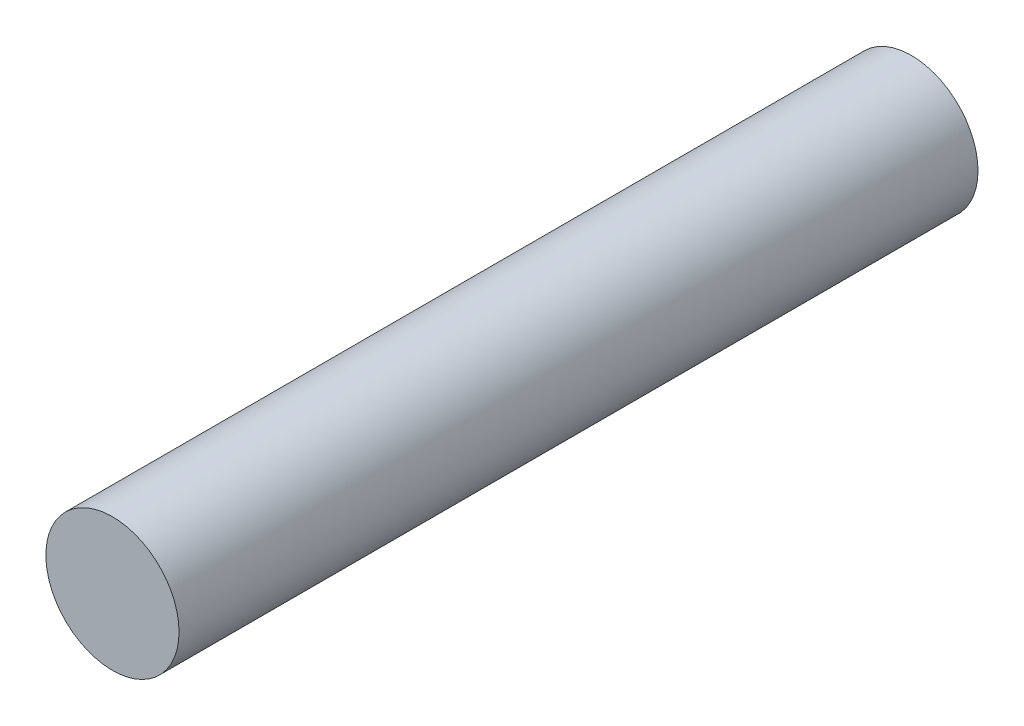
ISO-10303-21;
HEADER;
FILE_DESCRIPTION(('STEP AP214'),'2;1');
FILE_NAME('part.step','',(''),(''),'','','');
FILE_SCHEMA(('AUTOMOTIVE_DESIGN { 1 0 10303 214 1 1 1 1 }'));
ENDSEC;
DATA;
#1=APPLICATION_CONTEXT('core data for automotive mechanical design processes');
#2=APPLICATION_PROTOCOL_DEFINITION('international standard','automotive_design',2000,#1);
#3=PRODUCT_CONTEXT('',#1,'mechanical');
#4=PRODUCT('Part','Part','',(#3));
#5=PRODUCT_RELATED_PRODUCT_CATEGORY('part','',(#4));
#6=PRODUCT_DEFINITION_FORMATION('','',#4);
#7=PRODUCT_DEFINITION_CONTEXT('part definition',#1,'design');
#8=PRODUCT_DEFINITION('design','',#6,#7);
#9=PRODUCT_DEFINITION_SHAPE('','',#8);
#10=(LENGTH_UNIT() NAMED_UNIT(*) SI_UNIT(.MILLI.,.METRE.));
#11=(NAMED_UNIT(*) PLANE_ANGLE_UNIT() SI_UNIT($,.RADIAN.));
#12=(NAMED_UNIT(*) SI_UNIT($,.STERADIAN.) SOLID_ANGLE_UNIT());
#13=UNCERTAINTY_MEASURE_WITH_UNIT(LENGTH_MEASURE(1.E-05),#10,'distance_accuracy_value','');
#14=(GEOMETRIC_REPRESENTATION_CONTEXT(3) GLOBAL_UNCERTAINTY_ASSIGNED_CONTEXT((#13)) GLOBAL_UNIT_ASSIGNED_CONTEXT((#10,
#11,#12)) REPRESENTATION_CONTEXT('',''));
#15=CARTESIAN_POINT('',(0.,0.,0.));
#16=DIRECTION('',(0.,0.,1.));
#17=DIRECTION('',(1.,0.,0.));
#18=AXIS2_PLACEMENT_3D('',#15,#16,#17);
#19=CARTESIAN_POINT('',(0.,0.,30.));
#20=DIRECTION('',(0.,0.,-1.));
#21=DIRECTION('',(-1.,0.,0.));
#22=AXIS2_PLACEMENT_3D('',#19,#20,#21);
#23=CYLINDRICAL_SURFACE('',#22,2.5);
#24=CARTESIAN_POINT('',(0.,0.,30.));
#25=DIRECTION('',(0.,0.,1.));
#26=DIRECTION('',(1.,0.,0.));
#27=AXIS2_PLACEMENT_3D('',#24,#25,#26);
#28=CIRCLE('',#27,2.5);
#29=CARTESIAN_POINT('',(2.5,0.,30.));
#30=VERTEX_POINT('',#29);
#31=EDGE_CURVE('E10',#30,#30,#28,.T.);
#32=ORIENTED_EDGE('',*,*,#31,.F.);
#33=EDGE_LOOP('',(#32));
#34=FACE_BOUND('',#33,.T.);
#35=CARTESIAN_POINT('',(0.,0.,0.));
#36=DIRECTION('',(0.,0.,1.));
#37=DIRECTION('',(1.,0.,0.));
#38=AXIS2_PLACEMENT_3D('',#35,#36,#37);
#39=CIRCLE('',#38,2.5);
#40=CARTESIAN_POINT('',(2.5,0.,0.));
#41=VERTEX_POINT('',#40);
#42=EDGE_CURVE('E34',#41,#41,#39,.T.);
#43=ORIENTED_EDGE('',*,*,#42,.T.);
#44=EDGE_LOOP('',(#43));
#45=FACE_BOUND('',#44,.T.);
#46=ADVANCED_FACE('F31',(#34,#45),#23,.T.);
#47=CARTESIAN_POINT('',(0.,0.,30.));
#48=DIRECTION('',(0.,0.,1.));
#49=DIRECTION('',(1.,0.,0.));
#50=AXIS2_PLACEMENT_3D('',#47,#48,#49);
#51=PLANE('',#50);
#52=ORIENTED_EDGE('',*,*,#31,.T.);
#53=EDGE_LOOP('',(#52));
#54=FACE_BOUND('',#53,.T.);
#55=ADVANCED_FACE('F46',(#54),#51,.T.);
#56=CARTESIAN_POINT('',(0.,0.,0.));
#57=DIRECTION('',(0.,0.,1.));
#58=DIRECTION('',(1.,0.,0.));
#59=AXIS2_PLACEMENT_3D('',#56,#57,#58);
#60=PLANE('',#59);
#61=ORIENTED_EDGE('',*,*,#42,.F.);
#62=EDGE_LOOP('',(#61));
#63=FACE_BOUND('',#62,.T.);
#64=ADVANCED_FACE('F44',(#63),#60,.F.);
#65=CLOSED_SHELL('',(#46,#55,#64));
#66=MANIFOLD_SOLID_BREP('B2',#65);
#67=ADVANCED_BREP_SHAPE_REPRESENTATION('',(#18,#66),#14);
#68=SHAPE_DEFINITION_REPRESENTATION(#9,#67);
ENDSEC;
END-ISO-10303-21;
